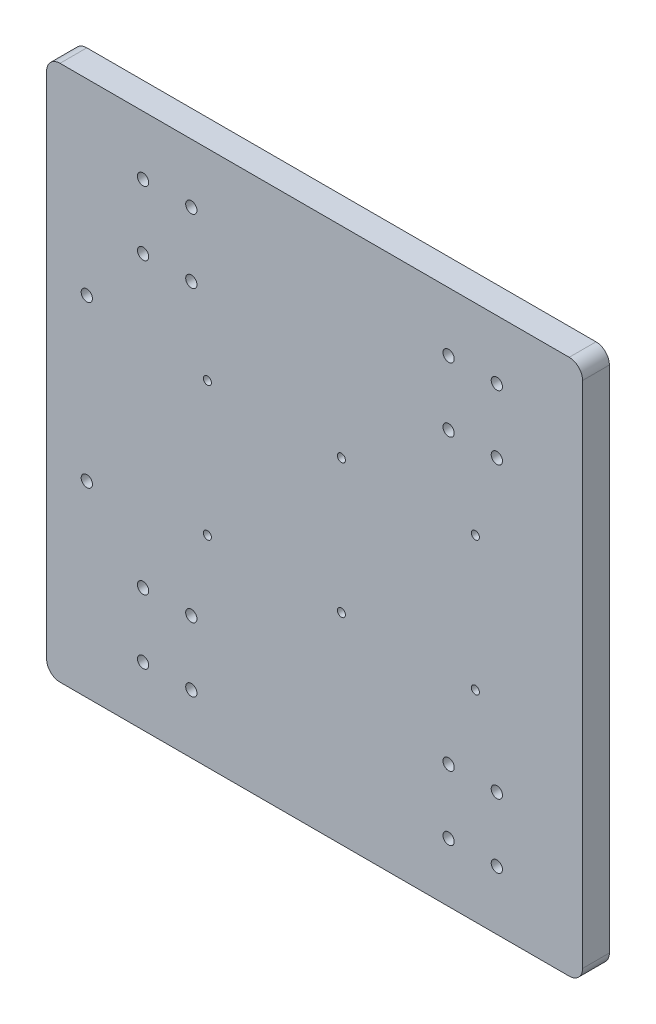
ISO-10303-21;
HEADER;
FILE_DESCRIPTION(('STEP AP214'),'2;1');
FILE_NAME('part.step','',(''),(''),'','','');
FILE_SCHEMA(('AUTOMOTIVE_DESIGN { 1 0 10303 214 1 1 1 1 }'));
ENDSEC;
DATA;
#1=APPLICATION_CONTEXT('core data for automotive mechanical design processes');
#2=APPLICATION_PROTOCOL_DEFINITION('international standard','automotive_design',2000,#1);
#3=PRODUCT_CONTEXT('',#1,'mechanical');
#4=PRODUCT('Part','Part','',(#3));
#5=PRODUCT_RELATED_PRODUCT_CATEGORY('part','',(#4));
#6=PRODUCT_DEFINITION_FORMATION('','',#4);
#7=PRODUCT_DEFINITION_CONTEXT('part definition',#1,'design');
#8=PRODUCT_DEFINITION('design','',#6,#7);
#9=PRODUCT_DEFINITION_SHAPE('','',#8);
#10=(LENGTH_UNIT() NAMED_UNIT(*) SI_UNIT(.MILLI.,.METRE.));
#11=(NAMED_UNIT(*) PLANE_ANGLE_UNIT() SI_UNIT($,.RADIAN.));
#12=(NAMED_UNIT(*) SI_UNIT($,.STERADIAN.) SOLID_ANGLE_UNIT());
#13=UNCERTAINTY_MEASURE_WITH_UNIT(LENGTH_MEASURE(1.E-05),#10,'distance_accuracy_value','');
#14=(GEOMETRIC_REPRESENTATION_CONTEXT(3) GLOBAL_UNCERTAINTY_ASSIGNED_CONTEXT((#13)) GLOBAL_UNIT_ASSIGNED_CONTEXT((#10,
#11,#12)) REPRESENTATION_CONTEXT('',''));
#15=CARTESIAN_POINT('',(0.,0.,0.));
#16=DIRECTION('',(0.,0.,1.));
#17=DIRECTION('',(1.,0.,0.));
#18=AXIS2_PLACEMENT_3D('',#15,#16,#17);
#19=CARTESIAN_POINT('',(179.,195.,10.));
#20=DIRECTION('',(0.,0.,1.));
#21=DIRECTION('',(1.,0.,0.));
#22=AXIS2_PLACEMENT_3D('',#19,#20,#21);
#23=PLANE('',#22);
#24=CARTESIAN_POINT('',(44.,125.,10.));
#25=DIRECTION('',(0.,0.,1.));
#26=DIRECTION('',(1.,0.,0.));
#27=AXIS2_PLACEMENT_3D('',#24,#25,#26);
#28=CIRCLE('',#27,1.5);
#29=CARTESIAN_POINT('',(45.5,125.,10.));
#30=VERTEX_POINT('',#29);
#31=EDGE_CURVE('E308',#30,#30,#28,.T.);
#32=ORIENTED_EDGE('',*,*,#31,.F.);
#33=EDGE_LOOP('',(#32));
#34=FACE_BOUND('',#33,.T.);
#35=CARTESIAN_POINT('',(94.,125.,10.));
#36=DIRECTION('',(0.,0.,1.));
#37=DIRECTION('',(1.,0.,0.));
#38=AXIS2_PLACEMENT_3D('',#35,#36,#37);
#39=CIRCLE('',#38,1.5);
#40=CARTESIAN_POINT('',(95.5,125.,10.));
#41=VERTEX_POINT('',#40);
#42=EDGE_CURVE('E296',#41,#41,#39,.T.);
#43=ORIENTED_EDGE('',*,*,#42,.F.);
#44=EDGE_LOOP('',(#43));
#45=FACE_BOUND('',#44,.T.);
#46=CARTESIAN_POINT('',(144.,125.,10.));
#47=DIRECTION('',(0.,0.,1.));
#48=DIRECTION('',(1.,0.,0.));
#49=AXIS2_PLACEMENT_3D('',#46,#47,#48);
#50=CIRCLE('',#49,1.5);
#51=CARTESIAN_POINT('',(145.5,125.,10.));
#52=VERTEX_POINT('',#51);
#53=EDGE_CURVE('E284',#52,#52,#50,.T.);
#54=ORIENTED_EDGE('',*,*,#53,.F.);
#55=EDGE_LOOP('',(#54));
#56=FACE_BOUND('',#55,.T.);
#57=CARTESIAN_POINT('',(134.,178.,10.));
#58=DIRECTION('',(0.,0.,1.));
#59=DIRECTION('',(1.,0.,0.));
#60=AXIS2_PLACEMENT_3D('',#57,#58,#59);
#61=CIRCLE('',#60,2.10000000000002);
#62=CARTESIAN_POINT('',(136.1,178.,10.));
#63=VERTEX_POINT('',#62);
#64=EDGE_CURVE('E272',#63,#63,#61,.T.);
#65=ORIENTED_EDGE('',*,*,#64,.F.);
#66=EDGE_LOOP('',(#65));
#67=FACE_BOUND('',#66,.T.);
#68=CARTESIAN_POINT('',(134.,22.,10.));
#69=DIRECTION('',(0.,0.,1.));
#70=DIRECTION('',(1.,0.,0.));
#71=AXIS2_PLACEMENT_3D('',#68,#69,#70);
#72=CIRCLE('',#71,2.10000000000002);
#73=CARTESIAN_POINT('',(136.1,22.,10.));
#74=VERTEX_POINT('',#73);
#75=EDGE_CURVE('E260',#74,#74,#72,.T.);
#76=ORIENTED_EDGE('',*,*,#75,.F.);
#77=EDGE_LOOP('',(#76));
#78=FACE_BOUND('',#77,.T.);
#79=CARTESIAN_POINT('',(20.,154.,10.));
#80=DIRECTION('',(0.,0.,1.));
#81=DIRECTION('',(1.,0.,0.));
#82=AXIS2_PLACEMENT_3D('',#79,#80,#81);
#83=CIRCLE('',#82,2.09999999999999);
#84=CARTESIAN_POINT('',(22.1,154.,10.));
#85=VERTEX_POINT('',#84);
#86=EDGE_CURVE('E248',#85,#85,#83,.T.);
#87=ORIENTED_EDGE('',*,*,#86,.F.);
#88=EDGE_LOOP('',(#87));
#89=FACE_BOUND('',#88,.T.);
#90=CARTESIAN_POINT('',(38.,22.,10.));
#91=DIRECTION('',(0.,0.,1.));
#92=DIRECTION('',(1.,0.,0.));
#93=AXIS2_PLACEMENT_3D('',#90,#91,#92);
#94=CIRCLE('',#93,2.09999999999999);
#95=CARTESIAN_POINT('',(40.1,22.,10.));
#96=VERTEX_POINT('',#95);
#97=EDGE_CURVE('E236',#96,#96,#94,.T.);
#98=ORIENTED_EDGE('',*,*,#97,.F.);
#99=EDGE_LOOP('',(#98));
#100=FACE_BOUND('',#99,.T.);
#101=CARTESIAN_POINT('',(38.,46.,10.));
#102=DIRECTION('',(0.,0.,1.));
#103=DIRECTION('',(1.,0.,0.));
#104=AXIS2_PLACEMENT_3D('',#101,#102,#103);
#105=CIRCLE('',#104,2.1);
#106=CARTESIAN_POINT('',(40.1,46.,10.));
#107=VERTEX_POINT('',#106);
#108=EDGE_CURVE('E224',#107,#107,#105,.T.);
#109=ORIENTED_EDGE('',*,*,#108,.F.);
#110=EDGE_LOOP('',(#109));
#111=FACE_BOUND('',#110,.T.);
#112=CARTESIAN_POINT('',(38.,154.,10.));
#113=DIRECTION('',(0.,0.,1.));
#114=DIRECTION('',(1.,0.,0.));
#115=AXIS2_PLACEMENT_3D('',#112,#113,#114);
#116=CIRCLE('',#115,2.09999999999999);
#117=CARTESIAN_POINT('',(40.1,154.,10.));
#118=VERTEX_POINT('',#117);
#119=EDGE_CURVE('E212',#118,#118,#116,.T.);
#120=ORIENTED_EDGE('',*,*,#119,.F.);
#121=EDGE_LOOP('',(#120));
#122=FACE_BOUND('',#121,.T.);
#123=CARTESIAN_POINT('',(152.,46.,10.));
#124=DIRECTION('',(0.,0.,1.));
#125=DIRECTION('',(1.,0.,0.));
#126=AXIS2_PLACEMENT_3D('',#123,#124,#125);
#127=CIRCLE('',#126,2.09999999999996);
#128=CARTESIAN_POINT('',(154.1,46.,10.));
#129=VERTEX_POINT('',#128);
#130=EDGE_CURVE('E200',#129,#129,#127,.T.);
#131=ORIENTED_EDGE('',*,*,#130,.F.);
#132=EDGE_LOOP('',(#131));
#133=FACE_BOUND('',#132,.T.);
#134=CARTESIAN_POINT('',(152.,154.,10.));
#135=DIRECTION('',(0.,0.,1.));
#136=DIRECTION('',(1.,0.,0.));
#137=AXIS2_PLACEMENT_3D('',#134,#135,#136);
#138=CIRCLE('',#137,2.09999999999996);
#139=CARTESIAN_POINT('',(154.1,154.,10.));
#140=VERTEX_POINT('',#139);
#141=EDGE_CURVE('E188',#140,#140,#138,.T.);
#142=ORIENTED_EDGE('',*,*,#141,.F.);
#143=EDGE_LOOP('',(#142));
#144=FACE_BOUND('',#143,.T.);
#145=CARTESIAN_POINT('',(-0.999999999999999,70.,10.));
#146=DIRECTION('',(0.,0.,1.));
#147=DIRECTION('',(1.,0.,0.));
#148=AXIS2_PLACEMENT_3D('',#145,#146,#147);
#149=CIRCLE('',#148,2.1);
#150=CARTESIAN_POINT('',(1.1,70.,10.));
#151=VERTEX_POINT('',#150);
#152=EDGE_CURVE('E134',#151,#151,#149,.T.);
#153=ORIENTED_EDGE('',*,*,#152,.F.);
#154=EDGE_LOOP('',(#153));
#155=FACE_BOUND('',#154,.T.);
#156=CARTESIAN_POINT('',(179.,195.,10.));
#157=DIRECTION('',(0.,0.,1.));
#158=DIRECTION('',(1.,0.,0.));
#159=AXIS2_PLACEMENT_3D('',#156,#157,#158);
#160=CIRCLE('',#159,5.);
#161=CARTESIAN_POINT('',(184.,195.,10.));
#162=VERTEX_POINT('',#161);
#163=CARTESIAN_POINT('',(179.,200.,10.));
#164=VERTEX_POINT('',#163);
#165=EDGE_CURVE('E145',#162,#164,#160,.T.);
#166=ORIENTED_EDGE('',*,*,#165,.T.);
#167=DIRECTION('',(-1.,0.,0.));
#168=VECTOR('',#167,1.);
#169=CARTESIAN_POINT('',(179.,200.,10.));
#170=LINE('',#169,#168);
#171=CARTESIAN_POINT('',(-11.,200.,10.));
#172=VERTEX_POINT('',#171);
#173=EDGE_CURVE('E93',#164,#172,#170,.T.);
#174=ORIENTED_EDGE('',*,*,#173,.T.);
#175=CARTESIAN_POINT('',(-11.,195.,10.));
#176=DIRECTION('',(0.,0.,1.));
#177=DIRECTION('',(1.,0.,0.));
#178=AXIS2_PLACEMENT_3D('',#175,#176,#177);
#179=CIRCLE('',#178,5.);
#180=CARTESIAN_POINT('',(-16.,195.,10.));
#181=VERTEX_POINT('',#180);
#182=EDGE_CURVE('E160',#172,#181,#179,.T.);
#183=ORIENTED_EDGE('',*,*,#182,.T.);
#184=DIRECTION('',(0.,-1.,0.));
#185=VECTOR('',#184,1.);
#186=CARTESIAN_POINT('',(-16.,195.,10.));
#187=LINE('',#186,#185);
#188=CARTESIAN_POINT('',(-16.,5.,10.));
#189=VERTEX_POINT('',#188);
#190=EDGE_CURVE('E173',#181,#189,#187,.T.);
#191=ORIENTED_EDGE('',*,*,#190,.T.);
#192=CARTESIAN_POINT('',(-11.,5.,10.));
#193=DIRECTION('',(0.,0.,1.));
#194=DIRECTION('',(1.,0.,0.));
#195=AXIS2_PLACEMENT_3D('',#192,#193,#194);
#196=CIRCLE('',#195,5.);
#197=CARTESIAN_POINT('',(-11.,0.,10.));
#198=VERTEX_POINT('',#197);
#199=EDGE_CURVE('E112',#189,#198,#196,.T.);
#200=ORIENTED_EDGE('',*,*,#199,.T.);
#201=DIRECTION('',(1.,0.,0.));
#202=VECTOR('',#201,1.);
#203=CARTESIAN_POINT('',(-11.,0.,10.));
#204=LINE('',#203,#202);
#205=CARTESIAN_POINT('',(179.,0.,10.));
#206=VERTEX_POINT('',#205);
#207=EDGE_CURVE('E106',#198,#206,#204,.T.);
#208=ORIENTED_EDGE('',*,*,#207,.T.);
#209=CARTESIAN_POINT('',(179.,5.00000000000003,10.));
#210=DIRECTION('',(0.,0.,1.));
#211=DIRECTION('',(1.,0.,0.));
#212=AXIS2_PLACEMENT_3D('',#209,#210,#211);
#213=CIRCLE('',#212,5.);
#214=CARTESIAN_POINT('',(184.,5.00000000000003,10.));
#215=VERTEX_POINT('',#214);
#216=EDGE_CURVE('E110',#206,#215,#213,.T.);
#217=ORIENTED_EDGE('',*,*,#216,.T.);
#218=DIRECTION('',(0.,1.,0.));
#219=VECTOR('',#218,1.);
#220=CARTESIAN_POINT('',(184.,5.00000000000003,10.));
#221=LINE('',#220,#219);
#222=EDGE_CURVE('E50',#215,#162,#221,.T.);
#223=ORIENTED_EDGE('',*,*,#222,.T.);
#224=EDGE_LOOP('',(#166,#174,#183,#191,#200,#208,#217,#223));
#225=FACE_BOUND('',#224,.T.);
#226=CARTESIAN_POINT('',(152.,178.,10.));
#227=DIRECTION('',(0.,0.,1.));
#228=DIRECTION('',(1.,0.,0.));
#229=AXIS2_PLACEMENT_3D('',#226,#227,#228);
#230=CIRCLE('',#229,2.09999999999999);
#231=CARTESIAN_POINT('',(154.1,178.,10.));
#232=VERTEX_POINT('',#231);
#233=EDGE_CURVE('E182',#232,#232,#230,.T.);
#234=ORIENTED_EDGE('',*,*,#233,.F.);
#235=EDGE_LOOP('',(#234));
#236=FACE_BOUND('',#235,.T.);
#237=CARTESIAN_POINT('',(152.,22.,10.));
#238=DIRECTION('',(0.,0.,1.));
#239=DIRECTION('',(1.,0.,0.));
#240=AXIS2_PLACEMENT_3D('',#237,#238,#239);
#241=CIRCLE('',#240,2.09999999999999);
#242=CARTESIAN_POINT('',(154.1,22.,10.));
#243=VERTEX_POINT('',#242);
#244=EDGE_CURVE('E194',#243,#243,#241,.T.);
#245=ORIENTED_EDGE('',*,*,#244,.F.);
#246=EDGE_LOOP('',(#245));
#247=FACE_BOUND('',#246,.T.);
#248=CARTESIAN_POINT('',(20.,178.,10.));
#249=DIRECTION('',(0.,0.,1.));
#250=DIRECTION('',(1.,0.,0.));
#251=AXIS2_PLACEMENT_3D('',#248,#249,#250);
#252=CIRCLE('',#251,2.1);
#253=CARTESIAN_POINT('',(22.1,178.,10.));
#254=VERTEX_POINT('',#253);
#255=EDGE_CURVE('E206',#254,#254,#252,.T.);
#256=ORIENTED_EDGE('',*,*,#255,.F.);
#257=EDGE_LOOP('',(#256));
#258=FACE_BOUND('',#257,.T.);
#259=CARTESIAN_POINT('',(20.,22.,10.));
#260=DIRECTION('',(0.,0.,1.));
#261=DIRECTION('',(1.,0.,0.));
#262=AXIS2_PLACEMENT_3D('',#259,#260,#261);
#263=CIRCLE('',#262,2.1);
#264=CARTESIAN_POINT('',(22.1,22.,10.));
#265=VERTEX_POINT('',#264);
#266=EDGE_CURVE('E218',#265,#265,#263,.T.);
#267=ORIENTED_EDGE('',*,*,#266,.F.);
#268=EDGE_LOOP('',(#267));
#269=FACE_BOUND('',#268,.T.);
#270=CARTESIAN_POINT('',(20.,46.0000000000001,10.));
#271=DIRECTION('',(0.,0.,1.));
#272=DIRECTION('',(1.,0.,0.));
#273=AXIS2_PLACEMENT_3D('',#270,#271,#272);
#274=CIRCLE('',#273,2.1);
#275=CARTESIAN_POINT('',(22.1,46.0000000000001,10.));
#276=VERTEX_POINT('',#275);
#277=EDGE_CURVE('E230',#276,#276,#274,.T.);
#278=ORIENTED_EDGE('',*,*,#277,.F.);
#279=EDGE_LOOP('',(#278));
#280=FACE_BOUND('',#279,.T.);
#281=CARTESIAN_POINT('',(38.,178.,10.));
#282=DIRECTION('',(0.,0.,1.));
#283=DIRECTION('',(1.,0.,0.));
#284=AXIS2_PLACEMENT_3D('',#281,#282,#283);
#285=CIRCLE('',#284,2.1);
#286=CARTESIAN_POINT('',(40.1,178.,10.));
#287=VERTEX_POINT('',#286);
#288=EDGE_CURVE('E242',#287,#287,#285,.T.);
#289=ORIENTED_EDGE('',*,*,#288,.F.);
#290=EDGE_LOOP('',(#289));
#291=FACE_BOUND('',#290,.T.);
#292=CARTESIAN_POINT('',(134.,46.,10.));
#293=DIRECTION('',(0.,0.,1.));
#294=DIRECTION('',(1.,0.,0.));
#295=AXIS2_PLACEMENT_3D('',#292,#293,#294);
#296=CIRCLE('',#295,2.10000000000002);
#297=CARTESIAN_POINT('',(136.1,46.,10.));
#298=VERTEX_POINT('',#297);
#299=EDGE_CURVE('E254',#298,#298,#296,.T.);
#300=ORIENTED_EDGE('',*,*,#299,.F.);
#301=EDGE_LOOP('',(#300));
#302=FACE_BOUND('',#301,.T.);
#303=CARTESIAN_POINT('',(134.,154.,10.));
#304=DIRECTION('',(0.,0.,1.));
#305=DIRECTION('',(1.,0.,0.));
#306=AXIS2_PLACEMENT_3D('',#303,#304,#305);
#307=CIRCLE('',#306,2.10000000000002);
#308=CARTESIAN_POINT('',(136.1,154.,10.));
#309=VERTEX_POINT('',#308);
#310=EDGE_CURVE('E266',#309,#309,#307,.T.);
#311=ORIENTED_EDGE('',*,*,#310,.F.);
#312=EDGE_LOOP('',(#311));
#313=FACE_BOUND('',#312,.T.);
#314=CARTESIAN_POINT('',(-1.00000000000003,130.,10.));
#315=DIRECTION('',(0.,0.,1.));
#316=DIRECTION('',(1.,0.,0.));
#317=AXIS2_PLACEMENT_3D('',#314,#315,#316);
#318=CIRCLE('',#317,2.10000000000002);
#319=CARTESIAN_POINT('',(1.09999999999999,130.,10.));
#320=VERTEX_POINT('',#319);
#321=EDGE_CURVE('E278',#320,#320,#318,.T.);
#322=ORIENTED_EDGE('',*,*,#321,.F.);
#323=EDGE_LOOP('',(#322));
#324=FACE_BOUND('',#323,.T.);
#325=CARTESIAN_POINT('',(144.,75.0000000000001,10.));
#326=DIRECTION('',(0.,0.,1.));
#327=DIRECTION('',(1.,0.,0.));
#328=AXIS2_PLACEMENT_3D('',#325,#326,#327);
#329=CIRCLE('',#328,1.5);
#330=CARTESIAN_POINT('',(145.5,75.0000000000001,10.));
#331=VERTEX_POINT('',#330);
#332=EDGE_CURVE('E290',#331,#331,#329,.T.);
#333=ORIENTED_EDGE('',*,*,#332,.F.);
#334=EDGE_LOOP('',(#333));
#335=FACE_BOUND('',#334,.T.);
#336=CARTESIAN_POINT('',(94.,75.0000000000001,10.));
#337=DIRECTION('',(0.,0.,1.));
#338=DIRECTION('',(1.,0.,0.));
#339=AXIS2_PLACEMENT_3D('',#336,#337,#338);
#340=CIRCLE('',#339,1.5);
#341=CARTESIAN_POINT('',(95.5,75.0000000000001,10.));
#342=VERTEX_POINT('',#341);
#343=EDGE_CURVE('E302',#342,#342,#340,.T.);
#344=ORIENTED_EDGE('',*,*,#343,.F.);
#345=EDGE_LOOP('',(#344));
#346=FACE_BOUND('',#345,.T.);
#347=CARTESIAN_POINT('',(44.,75.0000000000001,10.));
#348=DIRECTION('',(0.,0.,1.));
#349=DIRECTION('',(1.,0.,0.));
#350=AXIS2_PLACEMENT_3D('',#347,#348,#349);
#351=CIRCLE('',#350,1.5);
#352=CARTESIAN_POINT('',(45.5,75.0000000000001,10.));
#353=VERTEX_POINT('',#352);
#354=EDGE_CURVE('E314',#353,#353,#351,.T.);
#355=ORIENTED_EDGE('',*,*,#354,.F.);
#356=EDGE_LOOP('',(#355));
#357=FACE_BOUND('',#356,.T.);
#358=ADVANCED_FACE('F33',(#34,#45,#56,#67,#78,#89,#100,#111,#122,#133,#144,#155,#225,#236,#247,
#258,#269,#280,#291,#302,#313,#324,#335,#346,#357),#23,.T.);
#359=CARTESIAN_POINT('',(179.,195.,0.));
#360=DIRECTION('',(0.,0.,1.));
#361=DIRECTION('',(1.,0.,0.));
#362=AXIS2_PLACEMENT_3D('',#359,#360,#361);
#363=PLANE('',#362);
#364=CARTESIAN_POINT('',(179.,195.,0.));
#365=DIRECTION('',(0.,0.,1.));
#366=DIRECTION('',(1.,0.,0.));
#367=AXIS2_PLACEMENT_3D('',#364,#365,#366);
#368=CIRCLE('',#367,5.);
#369=CARTESIAN_POINT('',(184.,195.,0.));
#370=VERTEX_POINT('',#369);
#371=CARTESIAN_POINT('',(179.,200.,0.));
#372=VERTEX_POINT('',#371);
#373=EDGE_CURVE('E130',#370,#372,#368,.T.);
#374=ORIENTED_EDGE('',*,*,#373,.F.);
#375=DIRECTION('',(0.,1.,0.));
#376=VECTOR('',#375,1.);
#377=CARTESIAN_POINT('',(184.,5.00000000000003,0.));
#378=LINE('',#377,#376);
#379=CARTESIAN_POINT('',(184.,5.00000000000003,0.));
#380=VERTEX_POINT('',#379);
#381=EDGE_CURVE('E85',#380,#370,#378,.T.);
#382=ORIENTED_EDGE('',*,*,#381,.F.);
#383=CARTESIAN_POINT('',(179.,5.00000000000003,0.));
#384=DIRECTION('',(0.,0.,1.));
#385=DIRECTION('',(1.,0.,0.));
#386=AXIS2_PLACEMENT_3D('',#383,#384,#385);
#387=CIRCLE('',#386,5.);
#388=CARTESIAN_POINT('',(179.,0.,0.));
#389=VERTEX_POINT('',#388);
#390=EDGE_CURVE('E79',#389,#380,#387,.T.);
#391=ORIENTED_EDGE('',*,*,#390,.F.);
#392=DIRECTION('',(1.,0.,0.));
#393=VECTOR('',#392,1.);
#394=CARTESIAN_POINT('',(-11.,0.,0.));
#395=LINE('',#394,#393);
#396=CARTESIAN_POINT('',(-11.,0.,0.));
#397=VERTEX_POINT('',#396);
#398=EDGE_CURVE('E120',#397,#389,#395,.T.);
#399=ORIENTED_EDGE('',*,*,#398,.F.);
#400=CARTESIAN_POINT('',(-11.,5.,0.));
#401=DIRECTION('',(0.,0.,1.));
#402=DIRECTION('',(1.,0.,0.));
#403=AXIS2_PLACEMENT_3D('',#400,#401,#402);
#404=CIRCLE('',#403,5.);
#405=CARTESIAN_POINT('',(-16.,5.,0.));
#406=VERTEX_POINT('',#405);
#407=EDGE_CURVE('E140',#406,#397,#404,.T.);
#408=ORIENTED_EDGE('',*,*,#407,.F.);
#409=DIRECTION('',(0.,-1.,0.));
#410=VECTOR('',#409,1.);
#411=CARTESIAN_POINT('',(-16.,195.,0.));
#412=LINE('',#411,#410);
#413=CARTESIAN_POINT('',(-16.,195.,0.));
#414=VERTEX_POINT('',#413);
#415=EDGE_CURVE('E138',#414,#406,#412,.T.);
#416=ORIENTED_EDGE('',*,*,#415,.F.);
#417=CARTESIAN_POINT('',(-11.,195.,0.));
#418=DIRECTION('',(0.,0.,1.));
#419=DIRECTION('',(1.,0.,0.));
#420=AXIS2_PLACEMENT_3D('',#417,#418,#419);
#421=CIRCLE('',#420,5.);
#422=CARTESIAN_POINT('',(-11.,200.,0.));
#423=VERTEX_POINT('',#422);
#424=EDGE_CURVE('E136',#423,#414,#421,.T.);
#425=ORIENTED_EDGE('',*,*,#424,.F.);
#426=DIRECTION('',(-1.,0.,0.));
#427=VECTOR('',#426,1.);
#428=CARTESIAN_POINT('',(179.,200.,0.));
#429=LINE('',#428,#427);
#430=EDGE_CURVE('E133',#372,#423,#429,.T.);
#431=ORIENTED_EDGE('',*,*,#430,.F.);
#432=EDGE_LOOP('',(#374,#382,#391,#399,#408,#416,#425,#431));
#433=FACE_BOUND('',#432,.T.);
#434=CARTESIAN_POINT('',(-0.999999999999999,70.,0.));
#435=DIRECTION('',(0.,0.,1.));
#436=DIRECTION('',(1.,0.,0.));
#437=AXIS2_PLACEMENT_3D('',#434,#435,#436);
#438=CIRCLE('',#437,2.1);
#439=CARTESIAN_POINT('',(1.1,70.,0.));
#440=VERTEX_POINT('',#439);
#441=EDGE_CURVE('E179',#440,#440,#438,.T.);
#442=ORIENTED_EDGE('',*,*,#441,.T.);
#443=EDGE_LOOP('',(#442));
#444=FACE_BOUND('',#443,.T.);
#445=CARTESIAN_POINT('',(152.,178.,0.));
#446=DIRECTION('',(0.,0.,1.));
#447=DIRECTION('',(1.,0.,0.));
#448=AXIS2_PLACEMENT_3D('',#445,#446,#447);
#449=CIRCLE('',#448,2.09999999999999);
#450=CARTESIAN_POINT('',(154.1,178.,0.));
#451=VERTEX_POINT('',#450);
#452=EDGE_CURVE('E185',#451,#451,#449,.T.);
#453=ORIENTED_EDGE('',*,*,#452,.T.);
#454=EDGE_LOOP('',(#453));
#455=FACE_BOUND('',#454,.T.);
#456=CARTESIAN_POINT('',(152.,154.,0.));
#457=DIRECTION('',(0.,0.,1.));
#458=DIRECTION('',(1.,0.,0.));
#459=AXIS2_PLACEMENT_3D('',#456,#457,#458);
#460=CIRCLE('',#459,2.09999999999996);
#461=CARTESIAN_POINT('',(154.1,154.,0.));
#462=VERTEX_POINT('',#461);
#463=EDGE_CURVE('E191',#462,#462,#460,.T.);
#464=ORIENTED_EDGE('',*,*,#463,.T.);
#465=EDGE_LOOP('',(#464));
#466=FACE_BOUND('',#465,.T.);
#467=CARTESIAN_POINT('',(152.,22.,0.));
#468=DIRECTION('',(0.,0.,1.));
#469=DIRECTION('',(1.,0.,0.));
#470=AXIS2_PLACEMENT_3D('',#467,#468,#469);
#471=CIRCLE('',#470,2.09999999999999);
#472=CARTESIAN_POINT('',(154.1,22.,0.));
#473=VERTEX_POINT('',#472);
#474=EDGE_CURVE('E197',#473,#473,#471,.T.);
#475=ORIENTED_EDGE('',*,*,#474,.T.);
#476=EDGE_LOOP('',(#475));
#477=FACE_BOUND('',#476,.T.);
#478=CARTESIAN_POINT('',(152.,46.,0.));
#479=DIRECTION('',(0.,0.,1.));
#480=DIRECTION('',(1.,0.,0.));
#481=AXIS2_PLACEMENT_3D('',#478,#479,#480);
#482=CIRCLE('',#481,2.09999999999996);
#483=CARTESIAN_POINT('',(154.1,46.,0.));
#484=VERTEX_POINT('',#483);
#485=EDGE_CURVE('E203',#484,#484,#482,.T.);
#486=ORIENTED_EDGE('',*,*,#485,.T.);
#487=EDGE_LOOP('',(#486));
#488=FACE_BOUND('',#487,.T.);
#489=CARTESIAN_POINT('',(20.,178.,0.));
#490=DIRECTION('',(0.,0.,1.));
#491=DIRECTION('',(1.,0.,0.));
#492=AXIS2_PLACEMENT_3D('',#489,#490,#491);
#493=CIRCLE('',#492,2.1);
#494=CARTESIAN_POINT('',(22.1,178.,0.));
#495=VERTEX_POINT('',#494);
#496=EDGE_CURVE('E209',#495,#495,#493,.T.);
#497=ORIENTED_EDGE('',*,*,#496,.T.);
#498=EDGE_LOOP('',(#497));
#499=FACE_BOUND('',#498,.T.);
#500=CARTESIAN_POINT('',(38.,154.,0.));
#501=DIRECTION('',(0.,0.,1.));
#502=DIRECTION('',(1.,0.,0.));
#503=AXIS2_PLACEMENT_3D('',#500,#501,#502);
#504=CIRCLE('',#503,2.09999999999999);
#505=CARTESIAN_POINT('',(40.1,154.,0.));
#506=VERTEX_POINT('',#505);
#507=EDGE_CURVE('E215',#506,#506,#504,.T.);
#508=ORIENTED_EDGE('',*,*,#507,.T.);
#509=EDGE_LOOP('',(#508));
#510=FACE_BOUND('',#509,.T.);
#511=CARTESIAN_POINT('',(20.,22.,0.));
#512=DIRECTION('',(0.,0.,1.));
#513=DIRECTION('',(1.,0.,0.));
#514=AXIS2_PLACEMENT_3D('',#511,#512,#513);
#515=CIRCLE('',#514,2.1);
#516=CARTESIAN_POINT('',(22.1,22.,0.));
#517=VERTEX_POINT('',#516);
#518=EDGE_CURVE('E221',#517,#517,#515,.T.);
#519=ORIENTED_EDGE('',*,*,#518,.T.);
#520=EDGE_LOOP('',(#519));
#521=FACE_BOUND('',#520,.T.);
#522=CARTESIAN_POINT('',(38.,46.,0.));
#523=DIRECTION('',(0.,0.,1.));
#524=DIRECTION('',(1.,0.,0.));
#525=AXIS2_PLACEMENT_3D('',#522,#523,#524);
#526=CIRCLE('',#525,2.1);
#527=CARTESIAN_POINT('',(40.1,46.,0.));
#528=VERTEX_POINT('',#527);
#529=EDGE_CURVE('E227',#528,#528,#526,.T.);
#530=ORIENTED_EDGE('',*,*,#529,.T.);
#531=EDGE_LOOP('',(#530));
#532=FACE_BOUND('',#531,.T.);
#533=CARTESIAN_POINT('',(20.,46.0000000000001,0.));
#534=DIRECTION('',(0.,0.,1.));
#535=DIRECTION('',(1.,0.,0.));
#536=AXIS2_PLACEMENT_3D('',#533,#534,#535);
#537=CIRCLE('',#536,2.1);
#538=CARTESIAN_POINT('',(22.1,46.0000000000001,0.));
#539=VERTEX_POINT('',#538);
#540=EDGE_CURVE('E233',#539,#539,#537,.T.);
#541=ORIENTED_EDGE('',*,*,#540,.T.);
#542=EDGE_LOOP('',(#541));
#543=FACE_BOUND('',#542,.T.);
#544=CARTESIAN_POINT('',(38.,22.,0.));
#545=DIRECTION('',(0.,0.,1.));
#546=DIRECTION('',(1.,0.,0.));
#547=AXIS2_PLACEMENT_3D('',#544,#545,#546);
#548=CIRCLE('',#547,2.09999999999999);
#549=CARTESIAN_POINT('',(40.1,22.,0.));
#550=VERTEX_POINT('',#549);
#551=EDGE_CURVE('E239',#550,#550,#548,.T.);
#552=ORIENTED_EDGE('',*,*,#551,.T.);
#553=EDGE_LOOP('',(#552));
#554=FACE_BOUND('',#553,.T.);
#555=CARTESIAN_POINT('',(38.,178.,0.));
#556=DIRECTION('',(0.,0.,1.));
#557=DIRECTION('',(1.,0.,0.));
#558=AXIS2_PLACEMENT_3D('',#555,#556,#557);
#559=CIRCLE('',#558,2.1);
#560=CARTESIAN_POINT('',(40.1,178.,0.));
#561=VERTEX_POINT('',#560);
#562=EDGE_CURVE('E245',#561,#561,#559,.T.);
#563=ORIENTED_EDGE('',*,*,#562,.T.);
#564=EDGE_LOOP('',(#563));
#565=FACE_BOUND('',#564,.T.);
#566=CARTESIAN_POINT('',(20.,154.,0.));
#567=DIRECTION('',(0.,0.,1.));
#568=DIRECTION('',(1.,0.,0.));
#569=AXIS2_PLACEMENT_3D('',#566,#567,#568);
#570=CIRCLE('',#569,2.09999999999999);
#571=CARTESIAN_POINT('',(22.1,154.,0.));
#572=VERTEX_POINT('',#571);
#573=EDGE_CURVE('E251',#572,#572,#570,.T.);
#574=ORIENTED_EDGE('',*,*,#573,.T.);
#575=EDGE_LOOP('',(#574));
#576=FACE_BOUND('',#575,.T.);
#577=CARTESIAN_POINT('',(134.,46.,0.));
#578=DIRECTION('',(0.,0.,1.));
#579=DIRECTION('',(1.,0.,0.));
#580=AXIS2_PLACEMENT_3D('',#577,#578,#579);
#581=CIRCLE('',#580,2.10000000000002);
#582=CARTESIAN_POINT('',(136.1,46.,0.));
#583=VERTEX_POINT('',#582);
#584=EDGE_CURVE('E257',#583,#583,#581,.T.);
#585=ORIENTED_EDGE('',*,*,#584,.T.);
#586=EDGE_LOOP('',(#585));
#587=FACE_BOUND('',#586,.T.);
#588=CARTESIAN_POINT('',(134.,22.,0.));
#589=DIRECTION('',(0.,0.,1.));
#590=DIRECTION('',(1.,0.,0.));
#591=AXIS2_PLACEMENT_3D('',#588,#589,#590);
#592=CIRCLE('',#591,2.10000000000002);
#593=CARTESIAN_POINT('',(136.1,22.,0.));
#594=VERTEX_POINT('',#593);
#595=EDGE_CURVE('E263',#594,#594,#592,.T.);
#596=ORIENTED_EDGE('',*,*,#595,.T.);
#597=EDGE_LOOP('',(#596));
#598=FACE_BOUND('',#597,.T.);
#599=CARTESIAN_POINT('',(134.,154.,0.));
#600=DIRECTION('',(0.,0.,1.));
#601=DIRECTION('',(1.,0.,0.));
#602=AXIS2_PLACEMENT_3D('',#599,#600,#601);
#603=CIRCLE('',#602,2.10000000000002);
#604=CARTESIAN_POINT('',(136.1,154.,0.));
#605=VERTEX_POINT('',#604);
#606=EDGE_CURVE('E269',#605,#605,#603,.T.);
#607=ORIENTED_EDGE('',*,*,#606,.T.);
#608=EDGE_LOOP('',(#607));
#609=FACE_BOUND('',#608,.T.);
#610=CARTESIAN_POINT('',(134.,178.,0.));
#611=DIRECTION('',(0.,0.,1.));
#612=DIRECTION('',(1.,0.,0.));
#613=AXIS2_PLACEMENT_3D('',#610,#611,#612);
#614=CIRCLE('',#613,2.10000000000002);
#615=CARTESIAN_POINT('',(136.1,178.,0.));
#616=VERTEX_POINT('',#615);
#617=EDGE_CURVE('E275',#616,#616,#614,.T.);
#618=ORIENTED_EDGE('',*,*,#617,.T.);
#619=EDGE_LOOP('',(#618));
#620=FACE_BOUND('',#619,.T.);
#621=CARTESIAN_POINT('',(-1.00000000000003,130.,0.));
#622=DIRECTION('',(0.,0.,1.));
#623=DIRECTION('',(1.,0.,0.));
#624=AXIS2_PLACEMENT_3D('',#621,#622,#623);
#625=CIRCLE('',#624,2.10000000000002);
#626=CARTESIAN_POINT('',(1.09999999999999,130.,0.));
#627=VERTEX_POINT('',#626);
#628=EDGE_CURVE('E281',#627,#627,#625,.T.);
#629=ORIENTED_EDGE('',*,*,#628,.T.);
#630=EDGE_LOOP('',(#629));
#631=FACE_BOUND('',#630,.T.);
#632=CARTESIAN_POINT('',(144.,125.,0.));
#633=DIRECTION('',(0.,0.,1.));
#634=DIRECTION('',(1.,0.,0.));
#635=AXIS2_PLACEMENT_3D('',#632,#633,#634);
#636=CIRCLE('',#635,1.5);
#637=CARTESIAN_POINT('',(145.5,125.,0.));
#638=VERTEX_POINT('',#637);
#639=EDGE_CURVE('E287',#638,#638,#636,.T.);
#640=ORIENTED_EDGE('',*,*,#639,.T.);
#641=EDGE_LOOP('',(#640));
#642=FACE_BOUND('',#641,.T.);
#643=CARTESIAN_POINT('',(144.,75.0000000000001,0.));
#644=DIRECTION('',(0.,0.,1.));
#645=DIRECTION('',(1.,0.,0.));
#646=AXIS2_PLACEMENT_3D('',#643,#644,#645);
#647=CIRCLE('',#646,1.5);
#648=CARTESIAN_POINT('',(145.5,75.0000000000001,0.));
#649=VERTEX_POINT('',#648);
#650=EDGE_CURVE('E293',#649,#649,#647,.T.);
#651=ORIENTED_EDGE('',*,*,#650,.T.);
#652=EDGE_LOOP('',(#651));
#653=FACE_BOUND('',#652,.T.);
#654=CARTESIAN_POINT('',(94.,125.,0.));
#655=DIRECTION('',(0.,0.,1.));
#656=DIRECTION('',(1.,0.,0.));
#657=AXIS2_PLACEMENT_3D('',#654,#655,#656);
#658=CIRCLE('',#657,1.5);
#659=CARTESIAN_POINT('',(95.5,125.,0.));
#660=VERTEX_POINT('',#659);
#661=EDGE_CURVE('E299',#660,#660,#658,.T.);
#662=ORIENTED_EDGE('',*,*,#661,.T.);
#663=EDGE_LOOP('',(#662));
#664=FACE_BOUND('',#663,.T.);
#665=CARTESIAN_POINT('',(94.,75.0000000000001,0.));
#666=DIRECTION('',(0.,0.,1.));
#667=DIRECTION('',(1.,0.,0.));
#668=AXIS2_PLACEMENT_3D('',#665,#666,#667);
#669=CIRCLE('',#668,1.5);
#670=CARTESIAN_POINT('',(95.5,75.0000000000001,0.));
#671=VERTEX_POINT('',#670);
#672=EDGE_CURVE('E305',#671,#671,#669,.T.);
#673=ORIENTED_EDGE('',*,*,#672,.T.);
#674=EDGE_LOOP('',(#673));
#675=FACE_BOUND('',#674,.T.);
#676=CARTESIAN_POINT('',(44.,125.,0.));
#677=DIRECTION('',(0.,0.,1.));
#678=DIRECTION('',(1.,0.,0.));
#679=AXIS2_PLACEMENT_3D('',#676,#677,#678);
#680=CIRCLE('',#679,1.5);
#681=CARTESIAN_POINT('',(45.5,125.,0.));
#682=VERTEX_POINT('',#681);
#683=EDGE_CURVE('E311',#682,#682,#680,.T.);
#684=ORIENTED_EDGE('',*,*,#683,.T.);
#685=EDGE_LOOP('',(#684));
#686=FACE_BOUND('',#685,.T.);
#687=CARTESIAN_POINT('',(44.,75.0000000000001,0.));
#688=DIRECTION('',(0.,0.,1.));
#689=DIRECTION('',(1.,0.,0.));
#690=AXIS2_PLACEMENT_3D('',#687,#688,#689);
#691=CIRCLE('',#690,1.5);
#692=CARTESIAN_POINT('',(45.5,75.0000000000001,0.));
#693=VERTEX_POINT('',#692);
#694=EDGE_CURVE('E317',#693,#693,#691,.T.);
#695=ORIENTED_EDGE('',*,*,#694,.T.);
#696=EDGE_LOOP('',(#695));
#697=FACE_BOUND('',#696,.T.);
#698=ADVANCED_FACE('F164',(#433,#444,#455,#466,#477,#488,#499,#510,#521,#532,#543,#554,#565,
#576,#587,#598,#609,#620,#631,#642,#653,#664,#675,#686,#697),#363,.F.);
#699=CARTESIAN_POINT('',(179.,195.,10.));
#700=DIRECTION('',(0.,0.,-1.));
#701=DIRECTION('',(-1.,0.,0.));
#702=AXIS2_PLACEMENT_3D('',#699,#700,#701);
#703=CYLINDRICAL_SURFACE('',#702,5.);
#704=ORIENTED_EDGE('',*,*,#373,.T.);
#705=DIRECTION('',(0.,0.,-1.));
#706=VECTOR('',#705,1.);
#707=CARTESIAN_POINT('',(179.,200.,10.));
#708=LINE('',#707,#706);
#709=EDGE_CURVE('E11',#164,#372,#708,.T.);
#710=ORIENTED_EDGE('',*,*,#709,.F.);
#711=ORIENTED_EDGE('',*,*,#165,.F.);
#712=DIRECTION('',(0.,0.,-1.));
#713=VECTOR('',#712,1.);
#714=CARTESIAN_POINT('',(184.,195.,10.));
#715=LINE('',#714,#713);
#716=EDGE_CURVE('E126',#162,#370,#715,.T.);
#717=ORIENTED_EDGE('',*,*,#716,.T.);
#718=EDGE_LOOP('',(#704,#710,#711,#717));
#719=FACE_BOUND('',#718,.T.);
#720=ADVANCED_FACE('F35',(#719),#703,.T.);
#721=CARTESIAN_POINT('',(179.,200.,10.));
#722=DIRECTION('',(0.,-1.,0.));
#723=DIRECTION('',(1.,0.,0.));
#724=AXIS2_PLACEMENT_3D('',#721,#722,#723);
#725=PLANE('',#724);
#726=ORIENTED_EDGE('',*,*,#430,.T.);
#727=DIRECTION('',(0.,0.,-1.));
#728=VECTOR('',#727,1.);
#729=CARTESIAN_POINT('',(-11.,200.,10.));
#730=LINE('',#729,#728);
#731=EDGE_CURVE('E42',#172,#423,#730,.T.);
#732=ORIENTED_EDGE('',*,*,#731,.F.);
#733=ORIENTED_EDGE('',*,*,#173,.F.);
#734=ORIENTED_EDGE('',*,*,#709,.T.);
#735=EDGE_LOOP('',(#726,#732,#733,#734));
#736=FACE_BOUND('',#735,.T.);
#737=ADVANCED_FACE('F351',(#736),#725,.F.);
#738=CARTESIAN_POINT('',(-11.,195.,10.));
#739=DIRECTION('',(0.,0.,-1.));
#740=DIRECTION('',(-1.,0.,0.));
#741=AXIS2_PLACEMENT_3D('',#738,#739,#740);
#742=CYLINDRICAL_SURFACE('',#741,5.);
#743=ORIENTED_EDGE('',*,*,#424,.T.);
#744=DIRECTION('',(0.,0.,-1.));
#745=VECTOR('',#744,1.);
#746=CARTESIAN_POINT('',(-16.,195.,10.));
#747=LINE('',#746,#745);
#748=EDGE_CURVE('E152',#181,#414,#747,.T.);
#749=ORIENTED_EDGE('',*,*,#748,.F.);
#750=ORIENTED_EDGE('',*,*,#182,.F.);
#751=ORIENTED_EDGE('',*,*,#731,.T.);
#752=EDGE_LOOP('',(#743,#749,#750,#751));
#753=FACE_BOUND('',#752,.T.);
#754=ADVANCED_FACE('F158',(#753),#742,.T.);
#755=CARTESIAN_POINT('',(-16.,195.,10.));
#756=DIRECTION('',(1.,0.,0.));
#757=DIRECTION('',(0.,1.,0.));
#758=AXIS2_PLACEMENT_3D('',#755,#756,#757);
#759=PLANE('',#758);
#760=ORIENTED_EDGE('',*,*,#415,.T.);
#761=DIRECTION('',(0.,0.,-1.));
#762=VECTOR('',#761,1.);
#763=CARTESIAN_POINT('',(-16.,5.,10.));
#764=LINE('',#763,#762);
#765=EDGE_CURVE('E149',#189,#406,#764,.T.);
#766=ORIENTED_EDGE('',*,*,#765,.F.);
#767=ORIENTED_EDGE('',*,*,#190,.F.);
#768=ORIENTED_EDGE('',*,*,#748,.T.);
#769=EDGE_LOOP('',(#760,#766,#767,#768));
#770=FACE_BOUND('',#769,.T.);
#771=ADVANCED_FACE('F169',(#770),#759,.F.);
#772=CARTESIAN_POINT('',(-11.,5.,10.));
#773=DIRECTION('',(0.,0.,-1.));
#774=DIRECTION('',(-1.,0.,0.));
#775=AXIS2_PLACEMENT_3D('',#772,#773,#774);
#776=CYLINDRICAL_SURFACE('',#775,5.);
#777=ORIENTED_EDGE('',*,*,#407,.T.);
#778=DIRECTION('',(0.,0.,-1.));
#779=VECTOR('',#778,1.);
#780=CARTESIAN_POINT('',(-11.,0.,10.));
#781=LINE('',#780,#779);
#782=EDGE_CURVE('E121',#198,#397,#781,.T.);
#783=ORIENTED_EDGE('',*,*,#782,.F.);
#784=ORIENTED_EDGE('',*,*,#199,.F.);
#785=ORIENTED_EDGE('',*,*,#765,.T.);
#786=EDGE_LOOP('',(#777,#783,#784,#785));
#787=FACE_BOUND('',#786,.T.);
#788=ADVANCED_FACE('F172',(#787),#776,.T.);
#789=CARTESIAN_POINT('',(-11.,0.,10.));
#790=DIRECTION('',(0.,1.,0.));
#791=DIRECTION('',(-1.,0.,0.));
#792=AXIS2_PLACEMENT_3D('',#789,#790,#791);
#793=PLANE('',#792);
#794=ORIENTED_EDGE('',*,*,#398,.T.);
#795=DIRECTION('',(0.,0.,-1.));
#796=VECTOR('',#795,1.);
#797=CARTESIAN_POINT('',(179.,0.,10.));
#798=LINE('',#797,#796);
#799=EDGE_CURVE('E117',#206,#389,#798,.T.);
#800=ORIENTED_EDGE('',*,*,#799,.F.);
#801=ORIENTED_EDGE('',*,*,#207,.F.);
#802=ORIENTED_EDGE('',*,*,#782,.T.);
#803=EDGE_LOOP('',(#794,#800,#801,#802));
#804=FACE_BOUND('',#803,.T.);
#805=ADVANCED_FACE('F118',(#804),#793,.F.);
#806=CARTESIAN_POINT('',(179.,5.00000000000003,10.));
#807=DIRECTION('',(0.,0.,-1.));
#808=DIRECTION('',(-1.,0.,0.));
#809=AXIS2_PLACEMENT_3D('',#806,#807,#808);
#810=CYLINDRICAL_SURFACE('',#809,5.);
#811=ORIENTED_EDGE('',*,*,#390,.T.);
#812=DIRECTION('',(0.,0.,-1.));
#813=VECTOR('',#812,1.);
#814=CARTESIAN_POINT('',(184.,5.00000000000003,10.));
#815=LINE('',#814,#813);
#816=EDGE_CURVE('E122',#215,#380,#815,.T.);
#817=ORIENTED_EDGE('',*,*,#816,.F.);
#818=ORIENTED_EDGE('',*,*,#216,.F.);
#819=ORIENTED_EDGE('',*,*,#799,.T.);
#820=EDGE_LOOP('',(#811,#817,#818,#819));
#821=FACE_BOUND('',#820,.T.);
#822=ADVANCED_FACE('F124',(#821),#810,.T.);
#823=CARTESIAN_POINT('',(184.,5.00000000000003,10.));
#824=DIRECTION('',(-1.,0.,0.));
#825=DIRECTION('',(0.,0.,1.));
#826=AXIS2_PLACEMENT_3D('',#823,#824,#825);
#827=PLANE('',#826);
#828=ORIENTED_EDGE('',*,*,#381,.T.);
#829=ORIENTED_EDGE('',*,*,#716,.F.);
#830=ORIENTED_EDGE('',*,*,#222,.F.);
#831=ORIENTED_EDGE('',*,*,#816,.T.);
#832=EDGE_LOOP('',(#828,#829,#830,#831));
#833=FACE_BOUND('',#832,.T.);
#834=ADVANCED_FACE('F339',(#833),#827,.F.);
#835=CARTESIAN_POINT('',(-0.999999999999999,70.,10.));
#836=DIRECTION('',(0.,0.,-1.));
#837=DIRECTION('',(-1.,0.,0.));
#838=AXIS2_PLACEMENT_3D('',#835,#836,#837);
#839=CYLINDRICAL_SURFACE('',#838,2.1);
#840=ORIENTED_EDGE('',*,*,#152,.T.);
#841=EDGE_LOOP('',(#840));
#842=FACE_BOUND('',#841,.T.);
#843=ORIENTED_EDGE('',*,*,#441,.F.);
#844=EDGE_LOOP('',(#843));
#845=FACE_BOUND('',#844,.T.);
#846=ADVANCED_FACE('F336',(#842,#845),#839,.F.);
#847=CARTESIAN_POINT('',(152.,178.,10.));
#848=DIRECTION('',(0.,0.,-1.));
#849=DIRECTION('',(-1.,0.,0.));
#850=AXIS2_PLACEMENT_3D('',#847,#848,#849);
#851=CYLINDRICAL_SURFACE('',#850,2.09999999999999);
#852=ORIENTED_EDGE('',*,*,#233,.T.);
#853=EDGE_LOOP('',(#852));
#854=FACE_BOUND('',#853,.T.);
#855=ORIENTED_EDGE('',*,*,#452,.F.);
#856=EDGE_LOOP('',(#855));
#857=FACE_BOUND('',#856,.T.);
#858=ADVANCED_FACE('F415',(#854,#857),#851,.F.);
#859=CARTESIAN_POINT('',(152.,154.,10.));
#860=DIRECTION('',(0.,0.,-1.));
#861=DIRECTION('',(-1.,0.,0.));
#862=AXIS2_PLACEMENT_3D('',#859,#860,#861);
#863=CYLINDRICAL_SURFACE('',#862,2.09999999999996);
#864=ORIENTED_EDGE('',*,*,#141,.T.);
#865=EDGE_LOOP('',(#864));
#866=FACE_BOUND('',#865,.T.);
#867=ORIENTED_EDGE('',*,*,#463,.F.);
#868=EDGE_LOOP('',(#867));
#869=FACE_BOUND('',#868,.T.);
#870=ADVANCED_FACE('F423',(#866,#869),#863,.F.);
#871=CARTESIAN_POINT('',(152.,22.,10.));
#872=DIRECTION('',(0.,0.,-1.));
#873=DIRECTION('',(-1.,0.,0.));
#874=AXIS2_PLACEMENT_3D('',#871,#872,#873);
#875=CYLINDRICAL_SURFACE('',#874,2.09999999999999);
#876=ORIENTED_EDGE('',*,*,#244,.T.);
#877=EDGE_LOOP('',(#876));
#878=FACE_BOUND('',#877,.T.);
#879=ORIENTED_EDGE('',*,*,#474,.F.);
#880=EDGE_LOOP('',(#879));
#881=FACE_BOUND('',#880,.T.);
#882=ADVANCED_FACE('F431',(#878,#881),#875,.F.);
#883=CARTESIAN_POINT('',(152.,46.,10.));
#884=DIRECTION('',(0.,0.,-1.));
#885=DIRECTION('',(-1.,0.,0.));
#886=AXIS2_PLACEMENT_3D('',#883,#884,#885);
#887=CYLINDRICAL_SURFACE('',#886,2.09999999999996);
#888=ORIENTED_EDGE('',*,*,#130,.T.);
#889=EDGE_LOOP('',(#888));
#890=FACE_BOUND('',#889,.T.);
#891=ORIENTED_EDGE('',*,*,#485,.F.);
#892=EDGE_LOOP('',(#891));
#893=FACE_BOUND('',#892,.T.);
#894=ADVANCED_FACE('F440',(#890,#893),#887,.F.);
#895=CARTESIAN_POINT('',(20.,178.,10.));
#896=DIRECTION('',(0.,0.,-1.));
#897=DIRECTION('',(-1.,0.,0.));
#898=AXIS2_PLACEMENT_3D('',#895,#896,#897);
#899=CYLINDRICAL_SURFACE('',#898,2.1);
#900=ORIENTED_EDGE('',*,*,#255,.T.);
#901=EDGE_LOOP('',(#900));
#902=FACE_BOUND('',#901,.T.);
#903=ORIENTED_EDGE('',*,*,#496,.F.);
#904=EDGE_LOOP('',(#903));
#905=FACE_BOUND('',#904,.T.);
#906=ADVANCED_FACE('F449',(#902,#905),#899,.F.);
#907=CARTESIAN_POINT('',(38.,154.,10.));
#908=DIRECTION('',(0.,0.,-1.));
#909=DIRECTION('',(-1.,0.,0.));
#910=AXIS2_PLACEMENT_3D('',#907,#908,#909);
#911=CYLINDRICAL_SURFACE('',#910,2.09999999999999);
#912=ORIENTED_EDGE('',*,*,#119,.T.);
#913=EDGE_LOOP('',(#912));
#914=FACE_BOUND('',#913,.T.);
#915=ORIENTED_EDGE('',*,*,#507,.F.);
#916=EDGE_LOOP('',(#915));
#917=FACE_BOUND('',#916,.T.);
#918=ADVANCED_FACE('F458',(#914,#917),#911,.F.);
#919=CARTESIAN_POINT('',(20.,22.,10.));
#920=DIRECTION('',(0.,0.,-1.));
#921=DIRECTION('',(-1.,0.,0.));
#922=AXIS2_PLACEMENT_3D('',#919,#920,#921);
#923=CYLINDRICAL_SURFACE('',#922,2.1);
#924=ORIENTED_EDGE('',*,*,#266,.T.);
#925=EDGE_LOOP('',(#924));
#926=FACE_BOUND('',#925,.T.);
#927=ORIENTED_EDGE('',*,*,#518,.F.);
#928=EDGE_LOOP('',(#927));
#929=FACE_BOUND('',#928,.T.);
#930=ADVANCED_FACE('F467',(#926,#929),#923,.F.);
#931=CARTESIAN_POINT('',(38.,46.,10.));
#932=DIRECTION('',(0.,0.,-1.));
#933=DIRECTION('',(-1.,0.,0.));
#934=AXIS2_PLACEMENT_3D('',#931,#932,#933);
#935=CYLINDRICAL_SURFACE('',#934,2.1);
#936=ORIENTED_EDGE('',*,*,#108,.T.);
#937=EDGE_LOOP('',(#936));
#938=FACE_BOUND('',#937,.T.);
#939=ORIENTED_EDGE('',*,*,#529,.F.);
#940=EDGE_LOOP('',(#939));
#941=FACE_BOUND('',#940,.T.);
#942=ADVANCED_FACE('F476',(#938,#941),#935,.F.);
#943=CARTESIAN_POINT('',(20.,46.0000000000001,10.));
#944=DIRECTION('',(0.,0.,-1.));
#945=DIRECTION('',(-1.,0.,0.));
#946=AXIS2_PLACEMENT_3D('',#943,#944,#945);
#947=CYLINDRICAL_SURFACE('',#946,2.1);
#948=ORIENTED_EDGE('',*,*,#277,.T.);
#949=EDGE_LOOP('',(#948));
#950=FACE_BOUND('',#949,.T.);
#951=ORIENTED_EDGE('',*,*,#540,.F.);
#952=EDGE_LOOP('',(#951));
#953=FACE_BOUND('',#952,.T.);
#954=ADVANCED_FACE('F485',(#950,#953),#947,.F.);
#955=CARTESIAN_POINT('',(38.,22.,10.));
#956=DIRECTION('',(0.,0.,-1.));
#957=DIRECTION('',(-1.,0.,0.));
#958=AXIS2_PLACEMENT_3D('',#955,#956,#957);
#959=CYLINDRICAL_SURFACE('',#958,2.09999999999999);
#960=ORIENTED_EDGE('',*,*,#97,.T.);
#961=EDGE_LOOP('',(#960));
#962=FACE_BOUND('',#961,.T.);
#963=ORIENTED_EDGE('',*,*,#551,.F.);
#964=EDGE_LOOP('',(#963));
#965=FACE_BOUND('',#964,.T.);
#966=ADVANCED_FACE('F494',(#962,#965),#959,.F.);
#967=CARTESIAN_POINT('',(38.,178.,10.));
#968=DIRECTION('',(0.,0.,-1.));
#969=DIRECTION('',(-1.,0.,0.));
#970=AXIS2_PLACEMENT_3D('',#967,#968,#969);
#971=CYLINDRICAL_SURFACE('',#970,2.1);
#972=ORIENTED_EDGE('',*,*,#288,.T.);
#973=EDGE_LOOP('',(#972));
#974=FACE_BOUND('',#973,.T.);
#975=ORIENTED_EDGE('',*,*,#562,.F.);
#976=EDGE_LOOP('',(#975));
#977=FACE_BOUND('',#976,.T.);
#978=ADVANCED_FACE('F503',(#974,#977),#971,.F.);
#979=CARTESIAN_POINT('',(20.,154.,10.));
#980=DIRECTION('',(0.,0.,-1.));
#981=DIRECTION('',(-1.,0.,0.));
#982=AXIS2_PLACEMENT_3D('',#979,#980,#981);
#983=CYLINDRICAL_SURFACE('',#982,2.09999999999999);
#984=ORIENTED_EDGE('',*,*,#86,.T.);
#985=EDGE_LOOP('',(#984));
#986=FACE_BOUND('',#985,.T.);
#987=ORIENTED_EDGE('',*,*,#573,.F.);
#988=EDGE_LOOP('',(#987));
#989=FACE_BOUND('',#988,.T.);
#990=ADVANCED_FACE('F512',(#986,#989),#983,.F.);
#991=CARTESIAN_POINT('',(134.,46.,10.));
#992=DIRECTION('',(0.,0.,-1.));
#993=DIRECTION('',(-1.,0.,0.));
#994=AXIS2_PLACEMENT_3D('',#991,#992,#993);
#995=CYLINDRICAL_SURFACE('',#994,2.10000000000002);
#996=ORIENTED_EDGE('',*,*,#299,.T.);
#997=EDGE_LOOP('',(#996));
#998=FACE_BOUND('',#997,.T.);
#999=ORIENTED_EDGE('',*,*,#584,.F.);
#1000=EDGE_LOOP('',(#999));
#1001=FACE_BOUND('',#1000,.T.);
#1002=ADVANCED_FACE('F521',(#998,#1001),#995,.F.);
#1003=CARTESIAN_POINT('',(134.,22.,10.));
#1004=DIRECTION('',(0.,0.,-1.));
#1005=DIRECTION('',(-1.,0.,0.));
#1006=AXIS2_PLACEMENT_3D('',#1003,#1004,#1005);
#1007=CYLINDRICAL_SURFACE('',#1006,2.10000000000002);
#1008=ORIENTED_EDGE('',*,*,#75,.T.);
#1009=EDGE_LOOP('',(#1008));
#1010=FACE_BOUND('',#1009,.T.);
#1011=ORIENTED_EDGE('',*,*,#595,.F.);
#1012=EDGE_LOOP('',(#1011));
#1013=FACE_BOUND('',#1012,.T.);
#1014=ADVANCED_FACE('F530',(#1010,#1013),#1007,.F.);
#1015=CARTESIAN_POINT('',(134.,154.,10.));
#1016=DIRECTION('',(0.,0.,-1.));
#1017=DIRECTION('',(-1.,0.,0.));
#1018=AXIS2_PLACEMENT_3D('',#1015,#1016,#1017);
#1019=CYLINDRICAL_SURFACE('',#1018,2.10000000000002);
#1020=ORIENTED_EDGE('',*,*,#310,.T.);
#1021=EDGE_LOOP('',(#1020));
#1022=FACE_BOUND('',#1021,.T.);
#1023=ORIENTED_EDGE('',*,*,#606,.F.);
#1024=EDGE_LOOP('',(#1023));
#1025=FACE_BOUND('',#1024,.T.);
#1026=ADVANCED_FACE('F539',(#1022,#1025),#1019,.F.);
#1027=CARTESIAN_POINT('',(134.,178.,10.));
#1028=DIRECTION('',(0.,0.,-1.));
#1029=DIRECTION('',(-1.,0.,0.));
#1030=AXIS2_PLACEMENT_3D('',#1027,#1028,#1029);
#1031=CYLINDRICAL_SURFACE('',#1030,2.10000000000002);
#1032=ORIENTED_EDGE('',*,*,#64,.T.);
#1033=EDGE_LOOP('',(#1032));
#1034=FACE_BOUND('',#1033,.T.);
#1035=ORIENTED_EDGE('',*,*,#617,.F.);
#1036=EDGE_LOOP('',(#1035));
#1037=FACE_BOUND('',#1036,.T.);
#1038=ADVANCED_FACE('F548',(#1034,#1037),#1031,.F.);
#1039=CARTESIAN_POINT('',(-1.00000000000003,130.,10.));
#1040=DIRECTION('',(0.,0.,-1.));
#1041=DIRECTION('',(-1.,0.,0.));
#1042=AXIS2_PLACEMENT_3D('',#1039,#1040,#1041);
#1043=CYLINDRICAL_SURFACE('',#1042,2.10000000000002);
#1044=ORIENTED_EDGE('',*,*,#321,.T.);
#1045=EDGE_LOOP('',(#1044));
#1046=FACE_BOUND('',#1045,.T.);
#1047=ORIENTED_EDGE('',*,*,#628,.F.);
#1048=EDGE_LOOP('',(#1047));
#1049=FACE_BOUND('',#1048,.T.);
#1050=ADVANCED_FACE('F557',(#1046,#1049),#1043,.F.);
#1051=CARTESIAN_POINT('',(144.,125.,10.));
#1052=DIRECTION('',(0.,0.,-1.));
#1053=DIRECTION('',(-1.,0.,0.));
#1054=AXIS2_PLACEMENT_3D('',#1051,#1052,#1053);
#1055=CYLINDRICAL_SURFACE('',#1054,1.5);
#1056=ORIENTED_EDGE('',*,*,#53,.T.);
#1057=EDGE_LOOP('',(#1056));
#1058=FACE_BOUND('',#1057,.T.);
#1059=ORIENTED_EDGE('',*,*,#639,.F.);
#1060=EDGE_LOOP('',(#1059));
#1061=FACE_BOUND('',#1060,.T.);
#1062=ADVANCED_FACE('F566',(#1058,#1061),#1055,.F.);
#1063=CARTESIAN_POINT('',(144.,75.0000000000001,10.));
#1064=DIRECTION('',(0.,0.,-1.));
#1065=DIRECTION('',(-1.,0.,0.));
#1066=AXIS2_PLACEMENT_3D('',#1063,#1064,#1065);
#1067=CYLINDRICAL_SURFACE('',#1066,1.5);
#1068=ORIENTED_EDGE('',*,*,#332,.T.);
#1069=EDGE_LOOP('',(#1068));
#1070=FACE_BOUND('',#1069,.T.);
#1071=ORIENTED_EDGE('',*,*,#650,.F.);
#1072=EDGE_LOOP('',(#1071));
#1073=FACE_BOUND('',#1072,.T.);
#1074=ADVANCED_FACE('F575',(#1070,#1073),#1067,.F.);
#1075=CARTESIAN_POINT('',(94.,125.,10.));
#1076=DIRECTION('',(0.,0.,-1.));
#1077=DIRECTION('',(-1.,0.,0.));
#1078=AXIS2_PLACEMENT_3D('',#1075,#1076,#1077);
#1079=CYLINDRICAL_SURFACE('',#1078,1.5);
#1080=ORIENTED_EDGE('',*,*,#42,.T.);
#1081=EDGE_LOOP('',(#1080));
#1082=FACE_BOUND('',#1081,.T.);
#1083=ORIENTED_EDGE('',*,*,#661,.F.);
#1084=EDGE_LOOP('',(#1083));
#1085=FACE_BOUND('',#1084,.T.);
#1086=ADVANCED_FACE('F584',(#1082,#1085),#1079,.F.);
#1087=CARTESIAN_POINT('',(94.,75.0000000000001,10.));
#1088=DIRECTION('',(0.,0.,-1.));
#1089=DIRECTION('',(-1.,0.,0.));
#1090=AXIS2_PLACEMENT_3D('',#1087,#1088,#1089);
#1091=CYLINDRICAL_SURFACE('',#1090,1.5);
#1092=ORIENTED_EDGE('',*,*,#343,.T.);
#1093=EDGE_LOOP('',(#1092));
#1094=FACE_BOUND('',#1093,.T.);
#1095=ORIENTED_EDGE('',*,*,#672,.F.);
#1096=EDGE_LOOP('',(#1095));
#1097=FACE_BOUND('',#1096,.T.);
#1098=ADVANCED_FACE('F593',(#1094,#1097),#1091,.F.);
#1099=CARTESIAN_POINT('',(44.,125.,10.));
#1100=DIRECTION('',(0.,0.,-1.));
#1101=DIRECTION('',(-1.,0.,0.));
#1102=AXIS2_PLACEMENT_3D('',#1099,#1100,#1101);
#1103=CYLINDRICAL_SURFACE('',#1102,1.5);
#1104=ORIENTED_EDGE('',*,*,#31,.T.);
#1105=EDGE_LOOP('',(#1104));
#1106=FACE_BOUND('',#1105,.T.);
#1107=ORIENTED_EDGE('',*,*,#683,.F.);
#1108=EDGE_LOOP('',(#1107));
#1109=FACE_BOUND('',#1108,.T.);
#1110=ADVANCED_FACE('F602',(#1106,#1109),#1103,.F.);
#1111=CARTESIAN_POINT('',(44.,75.0000000000001,10.));
#1112=DIRECTION('',(0.,0.,-1.));
#1113=DIRECTION('',(-1.,0.,0.));
#1114=AXIS2_PLACEMENT_3D('',#1111,#1112,#1113);
#1115=CYLINDRICAL_SURFACE('',#1114,1.5);
#1116=ORIENTED_EDGE('',*,*,#354,.T.);
#1117=EDGE_LOOP('',(#1116));
#1118=FACE_BOUND('',#1117,.T.);
#1119=ORIENTED_EDGE('',*,*,#694,.F.);
#1120=EDGE_LOOP('',(#1119));
#1121=FACE_BOUND('',#1120,.T.);
#1122=ADVANCED_FACE('F323',(#1118,#1121),#1115,.F.);
#1123=CLOSED_SHELL('',(#358,#698,#720,#737,#754,#771,#788,#805,#822,#834,#846,#858,#870,#882,
#894,#906,#918,#930,#942,#954,#966,#978,#990,#1002,#1014,#1026,#1038,#1050,#1062,#1074,#1086,
#1098,#1110,#1122));
#1124=MANIFOLD_SOLID_BREP('B2',#1123);
#1125=ADVANCED_BREP_SHAPE_REPRESENTATION('',(#18,#1124),#14);
#1126=SHAPE_DEFINITION_REPRESENTATION(#9,#1125);
ENDSEC;
END-ISO-10303-21;
